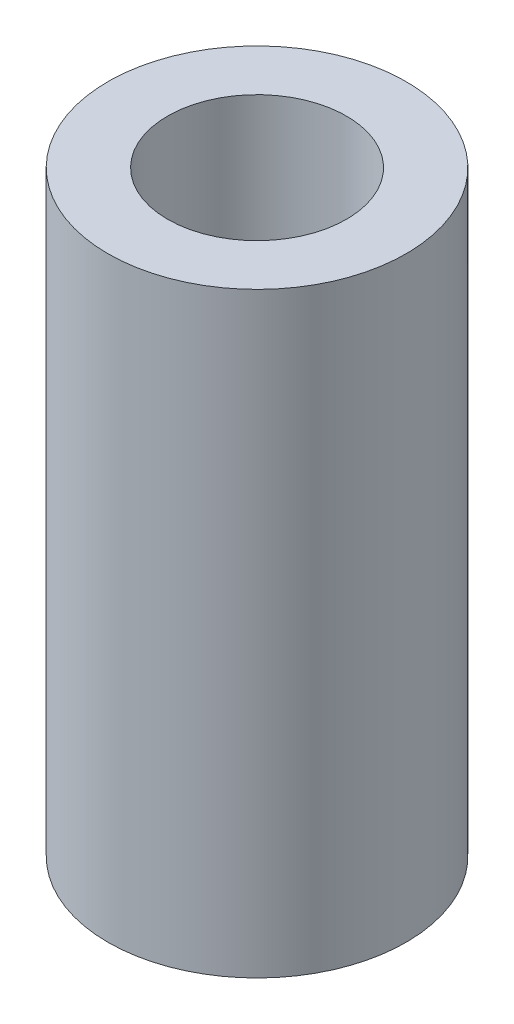
ISO-10303-21;
HEADER;
FILE_DESCRIPTION(('STEP AP214'),'2;1');
FILE_NAME('part.step','',(''),(''),'','','');
FILE_SCHEMA(('AUTOMOTIVE_DESIGN { 1 0 10303 214 1 1 1 1 }'));
ENDSEC;
DATA;
#1=APPLICATION_CONTEXT('core data for automotive mechanical design processes');
#2=APPLICATION_PROTOCOL_DEFINITION('international standard','automotive_design',2000,#1);
#3=PRODUCT_CONTEXT('',#1,'mechanical');
#4=PRODUCT('Part','Part','',(#3));
#5=PRODUCT_RELATED_PRODUCT_CATEGORY('part','',(#4));
#6=PRODUCT_DEFINITION_FORMATION('','',#4);
#7=PRODUCT_DEFINITION_CONTEXT('part definition',#1,'design');
#8=PRODUCT_DEFINITION('design','',#6,#7);
#9=PRODUCT_DEFINITION_SHAPE('','',#8);
#10=(LENGTH_UNIT() NAMED_UNIT(*) SI_UNIT(.MILLI.,.METRE.));
#11=(NAMED_UNIT(*) PLANE_ANGLE_UNIT() SI_UNIT($,.RADIAN.));
#12=(NAMED_UNIT(*) SI_UNIT($,.STERADIAN.) SOLID_ANGLE_UNIT());
#13=UNCERTAINTY_MEASURE_WITH_UNIT(LENGTH_MEASURE(1.E-05),#10,'distance_accuracy_value','');
#14=(GEOMETRIC_REPRESENTATION_CONTEXT(3) GLOBAL_UNCERTAINTY_ASSIGNED_CONTEXT((#13)) GLOBAL_UNIT_ASSIGNED_CONTEXT((#10,
#11,#12)) REPRESENTATION_CONTEXT('',''));
#15=CARTESIAN_POINT('',(0.,0.,0.));
#16=DIRECTION('',(0.,0.,1.));
#17=DIRECTION('',(1.,0.,0.));
#18=AXIS2_PLACEMENT_3D('',#15,#16,#17);
#19=CARTESIAN_POINT('',(0.,25.4,0.));
#20=DIRECTION('',(0.,1.,0.));
#21=DIRECTION('',(0.,0.,1.));
#22=AXIS2_PLACEMENT_3D('',#19,#20,#21);
#23=PLANE('',#22);
#24=CARTESIAN_POINT('',(0.,25.4,0.));
#25=DIRECTION('',(0.,1.,0.));
#26=DIRECTION('',(0.,0.,1.));
#27=AXIS2_PLACEMENT_3D('',#24,#25,#26);
#28=CIRCLE('',#27,6.35);
#29=CARTESIAN_POINT('',(0.,25.4,6.35));
#30=VERTEX_POINT('',#29);
#31=EDGE_CURVE('E10',#30,#30,#28,.T.);
#32=ORIENTED_EDGE('',*,*,#31,.T.);
#33=EDGE_LOOP('',(#32));
#34=FACE_BOUND('',#33,.T.);
#35=CARTESIAN_POINT('',(0.,25.4,0.));
#36=DIRECTION('',(0.,1.,0.));
#37=DIRECTION('',(0.,0.,1.));
#38=AXIS2_PLACEMENT_3D('',#35,#36,#37);
#39=CIRCLE('',#38,3.81);
#40=CARTESIAN_POINT('',(0.,25.4,3.81));
#41=VERTEX_POINT('',#40);
#42=EDGE_CURVE('E49',#41,#41,#39,.T.);
#43=ORIENTED_EDGE('',*,*,#42,.F.);
#44=EDGE_LOOP('',(#43));
#45=FACE_BOUND('',#44,.T.);
#46=ADVANCED_FACE('F38',(#34,#45),#23,.T.);
#47=CARTESIAN_POINT('',(0.,0.,0.));
#48=DIRECTION('',(0.,1.,0.));
#49=DIRECTION('',(0.,0.,1.));
#50=AXIS2_PLACEMENT_3D('',#47,#48,#49);
#51=PLANE('',#50);
#52=CARTESIAN_POINT('',(0.,0.,0.));
#53=DIRECTION('',(0.,1.,0.));
#54=DIRECTION('',(0.,0.,1.));
#55=AXIS2_PLACEMENT_3D('',#52,#53,#54);
#56=CIRCLE('',#55,6.35);
#57=CARTESIAN_POINT('',(0.,0.,6.35));
#58=VERTEX_POINT('',#57);
#59=EDGE_CURVE('E42',#58,#58,#56,.T.);
#60=ORIENTED_EDGE('',*,*,#59,.F.);
#61=EDGE_LOOP('',(#60));
#62=FACE_BOUND('',#61,.T.);
#63=CARTESIAN_POINT('',(0.,0.,0.));
#64=DIRECTION('',(0.,1.,0.));
#65=DIRECTION('',(0.,0.,1.));
#66=AXIS2_PLACEMENT_3D('',#63,#64,#65);
#67=CIRCLE('',#66,3.81);
#68=CARTESIAN_POINT('',(0.,0.,3.81));
#69=VERTEX_POINT('',#68);
#70=EDGE_CURVE('E51',#69,#69,#67,.T.);
#71=ORIENTED_EDGE('',*,*,#70,.T.);
#72=EDGE_LOOP('',(#71));
#73=FACE_BOUND('',#72,.T.);
#74=ADVANCED_FACE('F61',(#62,#73),#51,.F.);
#75=CARTESIAN_POINT('',(0.,25.4,0.));
#76=DIRECTION('',(0.,-1.,0.));
#77=DIRECTION('',(0.,0.,-1.));
#78=AXIS2_PLACEMENT_3D('',#75,#76,#77);
#79=CYLINDRICAL_SURFACE('',#78,6.35);
#80=ORIENTED_EDGE('',*,*,#31,.F.);
#81=EDGE_LOOP('',(#80));
#82=FACE_BOUND('',#81,.T.);
#83=ORIENTED_EDGE('',*,*,#59,.T.);
#84=EDGE_LOOP('',(#83));
#85=FACE_BOUND('',#84,.T.);
#86=ADVANCED_FACE('F40',(#82,#85),#79,.T.);
#87=CARTESIAN_POINT('',(0.,25.4,0.));
#88=DIRECTION('',(0.,-1.,0.));
#89=DIRECTION('',(0.,0.,-1.));
#90=AXIS2_PLACEMENT_3D('',#87,#88,#89);
#91=CYLINDRICAL_SURFACE('',#90,3.81);
#92=ORIENTED_EDGE('',*,*,#42,.T.);
#93=EDGE_LOOP('',(#92));
#94=FACE_BOUND('',#93,.T.);
#95=ORIENTED_EDGE('',*,*,#70,.F.);
#96=EDGE_LOOP('',(#95));
#97=FACE_BOUND('',#96,.T.);
#98=ADVANCED_FACE('F57',(#94,#97),#91,.F.);
#99=CLOSED_SHELL('',(#46,#74,#86,#98));
#100=MANIFOLD_SOLID_BREP('B2',#99);
#101=ADVANCED_BREP_SHAPE_REPRESENTATION('',(#18,#100),#14);
#102=SHAPE_DEFINITION_REPRESENTATION(#9,#101);
ENDSEC;
END-ISO-10303-21;
